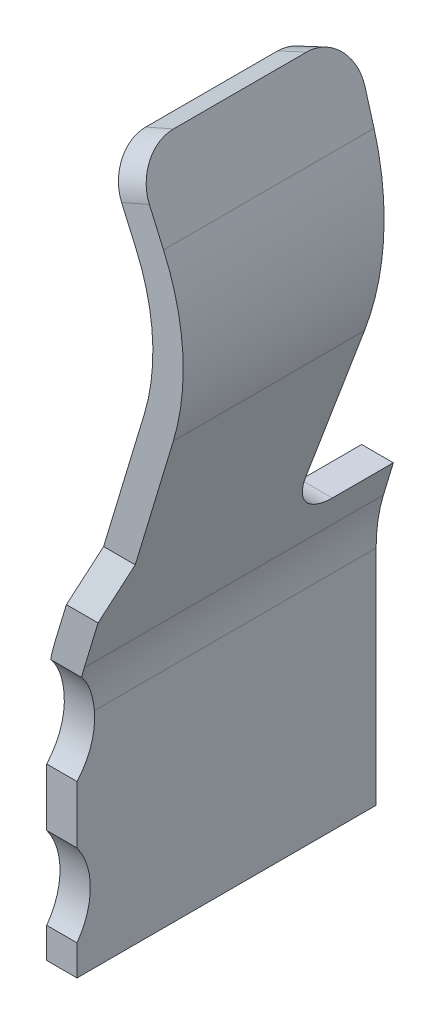
ISO-10303-21;
HEADER;
FILE_DESCRIPTION(('STEP AP214'),'2;1');
FILE_NAME('part.step','',(''),(''),'','','');
FILE_SCHEMA(('AUTOMOTIVE_DESIGN { 1 0 10303 214 1 1 1 1 }'));
ENDSEC;
DATA;
#1=APPLICATION_CONTEXT('core data for automotive mechanical design processes');
#2=APPLICATION_PROTOCOL_DEFINITION('international standard','automotive_design',2000,#1);
#3=PRODUCT_CONTEXT('',#1,'mechanical');
#4=PRODUCT('Part','Part','',(#3));
#5=PRODUCT_RELATED_PRODUCT_CATEGORY('part','',(#4));
#6=PRODUCT_DEFINITION_FORMATION('','',#4);
#7=PRODUCT_DEFINITION_CONTEXT('part definition',#1,'design');
#8=PRODUCT_DEFINITION('design','',#6,#7);
#9=PRODUCT_DEFINITION_SHAPE('','',#8);
#10=(LENGTH_UNIT() NAMED_UNIT(*) SI_UNIT(.MILLI.,.METRE.));
#11=(NAMED_UNIT(*) PLANE_ANGLE_UNIT() SI_UNIT($,.RADIAN.));
#12=(NAMED_UNIT(*) SI_UNIT($,.STERADIAN.) SOLID_ANGLE_UNIT());
#13=UNCERTAINTY_MEASURE_WITH_UNIT(LENGTH_MEASURE(1.E-05),#10,'distance_accuracy_value','');
#14=(GEOMETRIC_REPRESENTATION_CONTEXT(3) GLOBAL_UNCERTAINTY_ASSIGNED_CONTEXT((#13)) GLOBAL_UNIT_ASSIGNED_CONTEXT((#10,
#11,#12)) REPRESENTATION_CONTEXT('',''));
#15=CARTESIAN_POINT('',(0.,0.,0.));
#16=DIRECTION('',(0.,0.,1.));
#17=DIRECTION('',(1.,0.,0.));
#18=AXIS2_PLACEMENT_3D('',#15,#16,#17);
#19=CARTESIAN_POINT('',(8.30386274132999,3.53312166947706,-0.236832722369338));
#20=DIRECTION('',(-0.914255270392897,-0.402239697454475,0.0483789866630426));
#21=DIRECTION('',(0.402711251685505,-0.915327071470026,0.));
#22=AXIS2_PLACEMENT_3D('',#19,#20,#21);
#23=CYLINDRICAL_SURFACE('',#22,0.2);
#24=CARTESIAN_POINT('',(8.29035852267472,3.50329761180303,-0.434687053017797));
#25=CARTESIAN_POINT('',(8.23928159552815,3.6193909515076,-0.448650066039085));
#26=CARTESIAN_POINT('',(8.20101281648183,3.70637250294574,-0.363398989614743));
#27=CARTESIAN_POINT('',(8.20101281648182,3.70637250294574,-0.235652283248446));
#28=(BOUNDED_CURVE() B_SPLINE_CURVE(3,(#24,#25,#26,#27),.UNSPECIFIED.,.F.,
.F.) B_SPLINE_CURVE_WITH_KNOTS((4,4),(3.0320715031167,4.71238898038462),
.UNSPECIFIED.) CURVE() GEOMETRIC_REPRESENTATION_ITEM() RATIONAL_B_SPLINE_CURVE((1.,
0.77822974253387,0.77822974253387,1.)) REPRESENTATION_ITEM(''));
#29=CARTESIAN_POINT('',(8.29035852267472,3.50329761180303,-0.434687053017797));
#30=VERTEX_POINT('',#29);
#31=CARTESIAN_POINT('',(8.20101281648182,3.70637250294574,-0.235652283248446));
#32=VERTEX_POINT('',#31);
#33=EDGE_CURVE('E300',#30,#32,#28,.T.);
#34=ORIENTED_EDGE('',*,*,#33,.F.);
#35=DIRECTION('',(0.914255270392898,0.402239697454473,-0.0483789866630426));
#36=VECTOR('',#35,1.);
#37=CARTESIAN_POINT('',(-15.757177596038,-7.07676024092296,0.837819069551529));
#38=LINE('',#37,#36);
#39=CARTESIAN_POINT('',(8.15305946195422,3.44289092405021,-0.427421697659669));
#40=VERTEX_POINT('',#39);
#41=EDGE_CURVE('E11',#40,#30,#38,.T.);
#42=ORIENTED_EDGE('',*,*,#41,.F.);
#43=CARTESIAN_POINT('',(8.06371375576131,3.64596581519291,-0.228386927890318));
#44=CARTESIAN_POINT('',(8.06371375576132,3.64596581519291,-0.356133634256616));
#45=CARTESIAN_POINT('',(8.10198253480764,3.55898426375477,-0.441384710680957));
#46=CARTESIAN_POINT('',(8.15305946195422,3.44289092405021,-0.427421697659669));
#47=(BOUNDED_CURVE() B_SPLINE_CURVE(3,(#43,#44,#45,#46),.UNSPECIFIED.,.F.,
.F.) B_SPLINE_CURVE_WITH_KNOTS((4,4),(1.57079632679495,3.25111380406287),
.UNSPECIFIED.) CURVE() GEOMETRIC_REPRESENTATION_ITEM() RATIONAL_B_SPLINE_CURVE((1.,
0.778229742533869,0.778229742533869,1.)) REPRESENTATION_ITEM(''));
#48=CARTESIAN_POINT('',(8.06371375576131,3.64596581519291,-0.228386927890318));
#49=VERTEX_POINT('',#48);
#50=EDGE_CURVE('E309',#49,#40,#47,.T.);
#51=ORIENTED_EDGE('',*,*,#50,.F.);
#52=DIRECTION('',(-0.914255270392898,-0.402239697454473,0.0483789866630426));
#53=VECTOR('',#52,1.);
#54=CARTESIAN_POINT('',(8.22332049099288,3.71618708377106,-0.236832722369339));
#55=LINE('',#54,#53);
#56=EDGE_CURVE('E552',#32,#49,#55,.T.);
#57=ORIENTED_EDGE('',*,*,#56,.F.);
#58=EDGE_LOOP('',(#34,#42,#51,#57));
#59=FACE_BOUND('',#58,.T.);
#60=ADVANCED_FACE('F16',(#59),#23,.T.);
#61=CARTESIAN_POINT('',(8.28155506681891,3.52330708865174,0.423604352914838));
#62=DIRECTION('',(0.915327071470026,0.402711251685505,0.));
#63=DIRECTION('',(-0.402711251685505,0.915327071470026,0.));
#64=AXIS2_PLACEMENT_3D('',#61,#62,#63);
#65=CYLINDRICAL_SURFACE('',#64,0.2);
#66=CARTESIAN_POINT('',(8.14425600609841,3.46290040089891,0.423604352914837));
#67=DIRECTION('',(-0.915327071470029,-0.402711251685498,0.));
#68=DIRECTION('',(-0.402711251685498,0.915327071470029,0.));
#69=AXIS2_PLACEMENT_3D('',#66,#67,#68);
#70=CIRCLE('',#69,0.2);
#71=CARTESIAN_POINT('',(8.14425600609841,3.46290040089891,0.623604352914837));
#72=VERTEX_POINT('',#71);
#73=CARTESIAN_POINT('',(8.06371375576131,3.64596581519291,0.423604352914837));
#74=VERTEX_POINT('',#73);
#75=EDGE_CURVE('E306',#72,#74,#70,.T.);
#76=ORIENTED_EDGE('',*,*,#75,.F.);
#77=DIRECTION('',(-0.915327071470027,-0.402711251685503,0.));
#78=VECTOR('',#77,1.);
#79=CARTESIAN_POINT('',(-16.4730633966531,-7.36784176638169,0.623604352914803));
#80=LINE('',#79,#78);
#81=CARTESIAN_POINT('',(8.28155506681891,3.52330708865174,0.623604352914837));
#82=VERTEX_POINT('',#81);
#83=EDGE_CURVE('E27',#82,#72,#80,.T.);
#84=ORIENTED_EDGE('',*,*,#83,.F.);
#85=CARTESIAN_POINT('',(8.28155506681891,3.52330708865174,0.423604352914838));
#86=DIRECTION('',(0.915327071470029,0.402711251685498,0.));
#87=DIRECTION('',(0.402711251685498,-0.915327071470029,0.));
#88=AXIS2_PLACEMENT_3D('',#85,#86,#87);
#89=CIRCLE('',#88,0.2);
#90=CARTESIAN_POINT('',(8.20101281648182,3.70637250294574,0.423604352914837));
#91=VERTEX_POINT('',#90);
#92=EDGE_CURVE('E589',#91,#82,#89,.T.);
#93=ORIENTED_EDGE('',*,*,#92,.F.);
#94=DIRECTION('',(0.915327071470027,0.402711251685503,0.));
#95=VECTOR('',#94,1.);
#96=CARTESIAN_POINT('',(8.20101281648182,3.70637250294574,0.423604352914837));
#97=LINE('',#96,#95);
#98=EDGE_CURVE('E299',#74,#91,#97,.T.);
#99=ORIENTED_EDGE('',*,*,#98,.F.);
#100=EDGE_LOOP('',(#76,#84,#93,#99));
#101=FACE_BOUND('',#100,.T.);
#102=ADVANCED_FACE('F18',(#101),#65,.T.);
#103=CARTESIAN_POINT('',(-20.57,1.65634067151207,-0.212546111318104));
#104=DIRECTION('',(0.,-1.,0.));
#105=DIRECTION('',(0.,0.,-1.));
#106=AXIS2_PLACEMENT_3D('',#103,#104,#105);
#107=PLANE('',#106);
#108=DIRECTION('',(0.,0.,-1.));
#109=VECTOR('',#108,1.);
#110=CARTESIAN_POINT('',(7.96849659089442,1.65634067151207,-0.740000000000021));
#111=LINE('',#110,#109);
#112=CARTESIAN_POINT('',(7.96849659089442,1.65634067151207,-0.438042305987955));
#113=VERTEX_POINT('',#112);
#114=CARTESIAN_POINT('',(7.96849659089442,1.65634067151207,-0.740000000000021));
#115=VERTEX_POINT('',#114);
#116=EDGE_CURVE('E515',#113,#115,#111,.T.);
#117=ORIENTED_EDGE('',*,*,#116,.F.);
#118=DIRECTION('',(1.,0.,0.));
#119=VECTOR('',#118,1.);
#120=CARTESIAN_POINT('',(8.12516492105845,1.65634067151207,-0.438042305987954));
#121=LINE('',#120,#119);
#122=CARTESIAN_POINT('',(8.12516492105846,1.65634067151207,-0.438042305987954));
#123=VERTEX_POINT('',#122);
#124=EDGE_CURVE('E530',#113,#123,#121,.T.);
#125=ORIENTED_EDGE('',*,*,#124,.T.);
#126=DIRECTION('',(0.,0.,1.));
#127=VECTOR('',#126,1.);
#128=CARTESIAN_POINT('',(8.12516492105846,1.65634067151207,-0.74000000000002));
#129=LINE('',#128,#127);
#130=CARTESIAN_POINT('',(8.12516492105846,1.65634067151207,-0.74000000000002));
#131=VERTEX_POINT('',#130);
#132=EDGE_CURVE('E625',#131,#123,#129,.T.);
#133=ORIENTED_EDGE('',*,*,#132,.F.);
#134=DIRECTION('',(-1.,0.,0.));
#135=VECTOR('',#134,1.);
#136=CARTESIAN_POINT('',(8.89,1.65634067151207,-0.740000000000019));
#137=LINE('',#136,#135);
#138=EDGE_CURVE('E246',#131,#115,#137,.T.);
#139=ORIENTED_EDGE('',*,*,#138,.T.);
#140=EDGE_LOOP('',(#117,#125,#133,#139));
#141=FACE_BOUND('',#140,.T.);
#142=ADVANCED_FACE('F368',(#141),#107,.F.);
#143=CARTESIAN_POINT('',(-20.57,3.70637250294571,-0.459111687165995));
#144=DIRECTION('',(0.,0.119413416546905,0.992844618230162));
#145=DIRECTION('',(1.,0.,0.));
#146=AXIS2_PLACEMENT_3D('',#143,#144,#145);
#147=PLANE('',#146);
#148=DIRECTION('',(0.286748539926818,0.951150986717315,-0.11439875574724));
#149=VECTOR('',#148,1.);
#150=CARTESIAN_POINT('',(8.09412236488806,1.55337185451571,-0.200161637444148));
#151=LINE('',#150,#149);
#152=CARTESIAN_POINT('',(8.19266002273041,1.88022335482146,-0.239473382341922));
#153=VERTEX_POINT('',#152);
#154=CARTESIAN_POINT('',(8.40020176045378,2.56864369924933,-0.322272466749581));
#155=VERTEX_POINT('',#154);
#156=EDGE_CURVE('E519',#153,#155,#151,.T.);
#157=ORIENTED_EDGE('',*,*,#156,.F.);
#158=DIRECTION('',(-1.,0.,0.));
#159=VECTOR('',#158,1.);
#160=CARTESIAN_POINT('',(7.96849659089441,1.88022335482146,-0.239473382341922));
#161=LINE('',#160,#159);
#162=CARTESIAN_POINT('',(8.03599169256638,1.88022335482146,-0.239473382341922));
#163=VERTEX_POINT('',#162);
#164=EDGE_CURVE('E271',#153,#163,#161,.T.);
#165=ORIENTED_EDGE('',*,*,#164,.T.);
#166=DIRECTION('',(-0.28674853992682,-0.951150986717314,0.11439875574724));
#167=VECTOR('',#166,1.);
#168=CARTESIAN_POINT('',(7.9503360451115,1.59610175610151,-0.205300934614505));
#169=LINE('',#168,#167);
#170=CARTESIAN_POINT('',(8.25658626409634,2.61194022573825,-0.327479914176623));
#171=VERTEX_POINT('',#170);
#172=EDGE_CURVE('E510',#171,#163,#169,.T.);
#173=ORIENTED_EDGE('',*,*,#172,.F.);
#174=CARTESIAN_POINT('',(8.21447669318342,3.30329498734983,-0.410631932744419));
#175=CARTESIAN_POINT('',(8.3114549897076,3.08287189317973,-0.384120760424612));
#176=CARTESIAN_POINT('',(8.32609551117657,2.84250387207174,-0.355210731501567));
#177=CARTESIAN_POINT('',(8.25658626409634,2.61194022573825,-0.327479914176623));
#178=(BOUNDED_CURVE() B_SPLINE_CURVE(3,(#174,#175,#176,#177),.UNSPECIFIED.,.F.,
.F.) B_SPLINE_CURVE_WITH_KNOTS((4,4),(4.29791199977039,5.00519872138853),
.UNSPECIFIED.) CURVE() GEOMETRIC_REPRESENTATION_ITEM() RATIONAL_B_SPLINE_CURVE((1.,
0.958744787021091,0.958744787021091,1.)) REPRESENTATION_ITEM(''));
#179=CARTESIAN_POINT('',(8.21447669318342,3.30329498734983,-0.410631932744419));
#180=VERTEX_POINT('',#179);
#181=EDGE_CURVE('E319',#180,#171,#178,.T.);
#182=ORIENTED_EDGE('',*,*,#181,.F.);
#183=DIRECTION('',(0.400292818236851,-0.909830186054405,0.109428936813833));
#184=VECTOR('',#183,1.);
#185=CARTESIAN_POINT('',(8.20004918034407,3.33608744850051,-0.414576013974334));
#186=LINE('',#185,#184);
#187=EDGE_CURVE('E599',#40,#180,#186,.T.);
#188=ORIENTED_EDGE('',*,*,#187,.F.);
#189=ORIENTED_EDGE('',*,*,#41,.T.);
#190=DIRECTION('',(-0.40029281823685,0.909830186054405,-0.109428936813833));
#191=VECTOR('',#190,1.);
#192=CARTESIAN_POINT('',(8.33766648991178,3.39577078475993,-0.421754368938235));
#193=LINE('',#192,#191);
#194=CARTESIAN_POINT('',(8.35177575390392,3.36370167510267,-0.417897288102547));
#195=VERTEX_POINT('',#194);
#196=EDGE_CURVE('E563',#195,#30,#193,.T.);
#197=ORIENTED_EDGE('',*,*,#196,.F.);
#198=CARTESIAN_POINT('',(8.40020176045378,2.56864369924933,-0.322272466749581));
#199=CARTESIAN_POINT('',(8.48013739459604,2.83379189253285,-0.354162906673267));
#200=CARTESIAN_POINT('',(8.46330079490673,3.11021511680704,-0.387409439934769));
#201=CARTESIAN_POINT('',(8.35177575390392,3.36370167510267,-0.417897288102547));
#202=(BOUNDED_CURVE() B_SPLINE_CURVE(3,(#198,#199,#200,#201),.UNSPECIFIED.,.F.,
.F.) B_SPLINE_CURVE_WITH_KNOTS((4,4),(1.27798658579106,1.98527330740919),
.UNSPECIFIED.) CURVE() GEOMETRIC_REPRESENTATION_ITEM() RATIONAL_B_SPLINE_CURVE((1.,
0.958744787021091,0.958744787021091,1.)) REPRESENTATION_ITEM(''));
#203=EDGE_CURVE('E276',#155,#195,#202,.T.);
#204=ORIENTED_EDGE('',*,*,#203,.F.);
#205=EDGE_LOOP('',(#157,#165,#173,#182,#188,#189,#197,#204));
#206=FACE_BOUND('',#205,.T.);
#207=ADVANCED_FACE('F365',(#206),#147,.F.);
#208=CARTESIAN_POINT('',(-20.57,1.94413292378283,0.623604352914797));
#209=DIRECTION('',(0.,0.,-1.));
#210=DIRECTION('',(0.,-1.,0.));
#211=AXIS2_PLACEMENT_3D('',#208,#209,#210);
#212=PLANE('',#211);
#213=DIRECTION('',(0.4027112516855,-0.915327071470028,0.));
#214=VECTOR('',#213,1.);
#215=CARTESIAN_POINT('',(8.35177575390392,3.36370167510267,0.623604352914838));
#216=LINE('',#215,#214);
#217=CARTESIAN_POINT('',(8.35177575390392,3.36370167510267,0.623604352914838));
#218=VERTEX_POINT('',#217);
#219=EDGE_CURVE('E570',#82,#218,#216,.T.);
#220=ORIENTED_EDGE('',*,*,#219,.F.);
#221=ORIENTED_EDGE('',*,*,#83,.T.);
#222=DIRECTION('',(-0.402711251685501,0.915327071470028,0.));
#223=VECTOR('',#222,1.);
#224=CARTESIAN_POINT('',(8.21447669318342,3.30329498734984,0.623604352914837));
#225=LINE('',#224,#223);
#226=CARTESIAN_POINT('',(8.21447669318341,3.30329498734983,0.623604352914837));
#227=VERTEX_POINT('',#226);
#228=EDGE_CURVE('E310',#227,#72,#225,.T.);
#229=ORIENTED_EDGE('',*,*,#228,.F.);
#230=CARTESIAN_POINT('',(7.29914962171338,2.90058373566433,0.623604352914836));
#231=DIRECTION('',(0.,0.,1.));
#232=DIRECTION('',(-1.,0.,0.));
#233=AXIS2_PLACEMENT_3D('',#230,#231,#232);
#234=CIRCLE('',#233,1.);
#235=CARTESIAN_POINT('',(8.25658626409634,2.61194022573825,0.623604352914837));
#236=VERTEX_POINT('',#235);
#237=EDGE_CURVE('E333',#236,#227,#234,.T.);
#238=ORIENTED_EDGE('',*,*,#237,.F.);
#239=DIRECTION('',(0.28864350992609,0.957436642382956,0.));
#240=VECTOR('',#239,1.);
#241=CARTESIAN_POINT('',(7.93256335761704,1.53714937485737,0.623604352914836));
#242=LINE('',#241,#240);
#243=CARTESIAN_POINT('',(8.05525884977164,1.94413292378283,0.623604352914837));
#244=VERTEX_POINT('',#243);
#245=EDGE_CURVE('E301',#244,#236,#242,.T.);
#246=ORIENTED_EDGE('',*,*,#245,.F.);
#247=DIRECTION('',(1.,0.,0.));
#248=VECTOR('',#247,1.);
#249=CARTESIAN_POINT('',(-20.57,1.94413292378283,0.623604352914797));
#250=LINE('',#249,#248);
#251=CARTESIAN_POINT('',(8.21192717993567,1.94413292378283,0.623604352914837));
#252=VERTEX_POINT('',#251);
#253=EDGE_CURVE('E284',#244,#252,#250,.T.);
#254=ORIENTED_EDGE('',*,*,#253,.T.);
#255=DIRECTION('',(-0.288643509926088,-0.957436642382956,0.));
#256=VECTOR('',#255,1.);
#257=CARTESIAN_POINT('',(8.07617885397448,1.49385284836845,0.623604352914837));
#258=LINE('',#257,#256);
#259=CARTESIAN_POINT('',(8.40020176045378,2.56864369924933,0.623604352914837));
#260=VERTEX_POINT('',#259);
#261=EDGE_CURVE('E559',#260,#252,#258,.T.);
#262=ORIENTED_EDGE('',*,*,#261,.F.);
#263=CARTESIAN_POINT('',(7.29914962171338,2.90058373566433,0.623604352914836));
#264=DIRECTION('',(0.,0.,-1.));
#265=DIRECTION('',(-1.,0.,0.));
#266=AXIS2_PLACEMENT_3D('',#263,#264,#265);
#267=CIRCLE('',#266,1.15);
#268=EDGE_CURVE('E616',#218,#260,#267,.T.);
#269=ORIENTED_EDGE('',*,*,#268,.F.);
#270=EDGE_LOOP('',(#220,#221,#229,#238,#246,#254,#262,#269));
#271=FACE_BOUND('',#270,.T.);
#272=ADVANCED_FACE('F362',(#271),#212,.F.);
#273=CARTESIAN_POINT('',(-20.57,1.7003498353216,0.749999999999972));
#274=DIRECTION('',(0.,-0.460287319631494,-0.887770005906065));
#275=DIRECTION('',(0.,-0.887770005906065,0.460287319631494));
#276=AXIS2_PLACEMENT_3D('',#273,#274,#275);
#277=PLANE('',#276);
#278=ORIENTED_EDGE('',*,*,#253,.F.);
#279=DIRECTION('',(0.258541028225373,0.857586072334425,-0.444637678635293));
#280=VECTOR('',#279,1.);
#281=CARTESIAN_POINT('',(8.11357656169356,2.13757401070795,0.523309818502746));
#282=LINE('',#281,#280);
#283=CARTESIAN_POINT('',(7.98757891232074,1.7196371362757,0.73999999999998));
#284=VERTEX_POINT('',#283);
#285=EDGE_CURVE('E305',#284,#244,#282,.T.);
#286=ORIENTED_EDGE('',*,*,#285,.F.);
#287=DIRECTION('',(-1.,0.,0.));
#288=VECTOR('',#287,1.);
#289=CARTESIAN_POINT('',(8.89,1.7196371362757,0.739999999999981));
#290=LINE('',#289,#288);
#291=CARTESIAN_POINT('',(8.14424724248477,1.7196371362757,0.73999999999998));
#292=VERTEX_POINT('',#291);
#293=EDGE_CURVE('E575',#292,#284,#290,.T.);
#294=ORIENTED_EDGE('',*,*,#293,.F.);
#295=DIRECTION('',(-0.258541028225372,-0.857586072334425,0.444637678635293));
#296=VECTOR('',#295,1.);
#297=CARTESIAN_POINT('',(8.2597726380838,2.10283732290249,0.541319952677682));
#298=LINE('',#297,#296);
#299=EDGE_CURVE('E283',#252,#292,#298,.T.);
#300=ORIENTED_EDGE('',*,*,#299,.F.);
#301=EDGE_LOOP('',(#278,#286,#294,#300));
#302=FACE_BOUND('',#301,.T.);
#303=ADVANCED_FACE('F364',(#302),#277,.F.);
#304=CARTESIAN_POINT('',(8.89,1.24850586493128,0.739999999999981));
#305=DIRECTION('',(0.,0.,-1.));
#306=DIRECTION('',(0.,-1.,0.));
#307=AXIS2_PLACEMENT_3D('',#304,#305,#306);
#308=PLANE('',#307);
#309=DIRECTION('',(0.,1.,0.));
#310=VECTOR('',#309,1.);
#311=CARTESIAN_POINT('',(8.04,0.145965815192914,0.73999999999998));
#312=LINE('',#311,#310);
#313=CARTESIAN_POINT('',(8.04,0.145965815192914,0.73999999999998));
#314=VERTEX_POINT('',#313);
#315=CARTESIAN_POINT('',(8.04,0.296740599868486,0.73999999999998));
#316=VERTEX_POINT('',#315);
#317=EDGE_CURVE('E314',#314,#316,#312,.T.);
#318=ORIENTED_EDGE('',*,*,#317,.T.);
#319=DIRECTION('',(-1.,0.,0.));
#320=VECTOR('',#319,1.);
#321=CARTESIAN_POINT('',(-20.57,0.296740599868486,0.73999999999994));
#322=LINE('',#321,#320);
#323=CARTESIAN_POINT('',(7.89,0.296740599868486,0.739999999999979));
#324=VERTEX_POINT('',#323);
#325=EDGE_CURVE('E242',#316,#324,#322,.T.);
#326=ORIENTED_EDGE('',*,*,#325,.T.);
#327=DIRECTION('',(0.,-1.,0.));
#328=VECTOR('',#327,1.);
#329=CARTESIAN_POINT('',(7.89,0.145965815192914,0.739999999999979));
#330=LINE('',#329,#328);
#331=CARTESIAN_POINT('',(7.89,0.145965815192914,0.739999999999979));
#332=VERTEX_POINT('',#331);
#333=EDGE_CURVE('E237',#324,#332,#330,.T.);
#334=ORIENTED_EDGE('',*,*,#333,.T.);
#335=DIRECTION('',(1.,0.,0.));
#336=VECTOR('',#335,1.);
#337=CARTESIAN_POINT('',(8.04,0.145965815192914,0.73999999999998));
#338=LINE('',#337,#336);
#339=EDGE_CURVE('E240',#332,#314,#338,.T.);
#340=ORIENTED_EDGE('',*,*,#339,.T.);
#341=EDGE_LOOP('',(#318,#326,#334,#340));
#342=FACE_BOUND('',#341,.T.);
#343=ADVANCED_FACE('F238',(#342),#308,.F.);
#344=CARTESIAN_POINT('',(8.89,1.24850586493128,-0.740000000000019));
#345=DIRECTION('',(0.,0.,-1.));
#346=DIRECTION('',(0.,-1.,0.));
#347=AXIS2_PLACEMENT_3D('',#344,#345,#346);
#348=PLANE('',#347);
#349=ORIENTED_EDGE('',*,*,#138,.F.);
#350=DIRECTION('',(0.288643509926088,0.957436642382956,0.));
#351=VECTOR('',#350,1.);
#352=CARTESIAN_POINT('',(8.07617885397449,1.49385284836845,-0.74000000000002));
#353=LINE('',#352,#351);
#354=CARTESIAN_POINT('',(8.07617885397449,1.49385284836845,-0.74000000000002));
#355=VERTEX_POINT('',#354);
#356=EDGE_CURVE('E318',#355,#131,#353,.T.);
#357=ORIENTED_EDGE('',*,*,#356,.F.);
#358=CARTESIAN_POINT('',(8.89,1.24850586493128,-0.740000000000019));
#359=DIRECTION('',(0.,0.,-1.));
#360=DIRECTION('',(1.,0.,0.));
#361=AXIS2_PLACEMENT_3D('',#358,#359,#360);
#362=CIRCLE('',#361,0.85);
#363=CARTESIAN_POINT('',(8.04,1.24850586493128,-0.74000000000002));
#364=VERTEX_POINT('',#363);
#365=EDGE_CURVE('E313',#364,#355,#362,.T.);
#366=ORIENTED_EDGE('',*,*,#365,.F.);
#367=DIRECTION('',(0.,1.,0.));
#368=VECTOR('',#367,1.);
#369=CARTESIAN_POINT('',(8.04,0.145965815192914,-0.74000000000002));
#370=LINE('',#369,#368);
#371=CARTESIAN_POINT('',(8.04,0.145965815192914,-0.74000000000002));
#372=VERTEX_POINT('',#371);
#373=EDGE_CURVE('E214',#372,#364,#370,.T.);
#374=ORIENTED_EDGE('',*,*,#373,.F.);
#375=DIRECTION('',(1.,0.,0.));
#376=VECTOR('',#375,1.);
#377=CARTESIAN_POINT('',(8.04,0.145965815192914,-0.74000000000002));
#378=LINE('',#377,#376);
#379=CARTESIAN_POINT('',(7.89,0.145965815192914,-0.740000000000021));
#380=VERTEX_POINT('',#379);
#381=EDGE_CURVE('E254',#380,#372,#378,.T.);
#382=ORIENTED_EDGE('',*,*,#381,.F.);
#383=DIRECTION('',(0.,-1.,0.));
#384=VECTOR('',#383,1.);
#385=CARTESIAN_POINT('',(7.89,0.145965815192914,-0.740000000000021));
#386=LINE('',#385,#384);
#387=CARTESIAN_POINT('',(7.89,1.24850586493128,-0.740000000000021));
#388=VERTEX_POINT('',#387);
#389=EDGE_CURVE('E42',#388,#380,#386,.T.);
#390=ORIENTED_EDGE('',*,*,#389,.F.);
#391=CARTESIAN_POINT('',(8.89,1.24850586493128,-0.740000000000019));
#392=DIRECTION('',(0.,0.,1.));
#393=DIRECTION('',(1.,0.,0.));
#394=AXIS2_PLACEMENT_3D('',#391,#392,#393);
#395=CIRCLE('',#394,1.);
#396=CARTESIAN_POINT('',(7.93256335761704,1.53714937485737,-0.740000000000021));
#397=VERTEX_POINT('',#396);
#398=EDGE_CURVE('E581',#397,#388,#395,.T.);
#399=ORIENTED_EDGE('',*,*,#398,.F.);
#400=DIRECTION('',(-0.28864350992609,-0.957436642382956,0.));
#401=VECTOR('',#400,1.);
#402=CARTESIAN_POINT('',(7.93256335761704,1.53714937485737,-0.740000000000021));
#403=LINE('',#402,#401);
#404=EDGE_CURVE('E580',#115,#397,#403,.T.);
#405=ORIENTED_EDGE('',*,*,#404,.F.);
#406=EDGE_LOOP('',(#349,#357,#366,#374,#382,#390,#399,#405));
#407=FACE_BOUND('',#406,.T.);
#408=ADVANCED_FACE('F387',(#407),#348,.T.);
#409=CARTESIAN_POINT('',(7.89,0.145965815192914,-0.740000000000021));
#410=DIRECTION('',(1.,0.,0.));
#411=DIRECTION('',(0.,1.,0.));
#412=AXIS2_PLACEMENT_3D('',#409,#410,#411);
#413=PLANE('',#412);
#414=DIRECTION('',(0.,-1.,0.));
#415=VECTOR('',#414,1.);
#416=CARTESIAN_POINT('',(7.89,0.145965815192914,0.739999999999979));
#417=LINE('',#416,#415);
#418=CARTESIAN_POINT('',(7.89,0.988055123608201,0.739999999999979));
#419=VERTEX_POINT('',#418);
#420=CARTESIAN_POINT('',(7.89,0.703259400131467,0.739999999999979));
#421=VERTEX_POINT('',#420);
#422=EDGE_CURVE('E260',#419,#421,#417,.T.);
#423=ORIENTED_EDGE('',*,*,#422,.F.);
#424=CARTESIAN_POINT('',(7.89,1.21669179396546,0.995153761033096));
#425=DIRECTION('',(1.,0.,0.));
#426=DIRECTION('',(0.,1.,0.));
#427=AXIS2_PLACEMENT_3D('',#424,#425,#426);
#428=CIRCLE('',#427,0.342604974863759);
#429=CARTESIAN_POINT('',(7.89,1.24850586493128,0.654029100989324));
#430=VERTEX_POINT('',#429);
#431=EDGE_CURVE('E274',#419,#430,#428,.T.);
#432=ORIENTED_EDGE('',*,*,#431,.T.);
#433=DIRECTION('',(0.,0.,1.));
#434=VECTOR('',#433,1.);
#435=CARTESIAN_POINT('',(7.89,1.24850586493128,-0.740000000000021));
#436=LINE('',#435,#434);
#437=EDGE_CURVE('E304',#388,#430,#436,.T.);
#438=ORIENTED_EDGE('',*,*,#437,.F.);
#439=ORIENTED_EDGE('',*,*,#389,.T.);
#440=DIRECTION('',(0.,0.,1.));
#441=VECTOR('',#440,1.);
#442=CARTESIAN_POINT('',(7.89,0.145965815192914,-0.740000000000021));
#443=LINE('',#442,#441);
#444=EDGE_CURVE('E249',#380,#332,#443,.T.);
#445=ORIENTED_EDGE('',*,*,#444,.T.);
#446=ORIENTED_EDGE('',*,*,#333,.F.);
#447=CARTESIAN_POINT('',(7.89,0.499999999999977,1.0194268345702));
#448=DIRECTION('',(1.,0.,0.));
#449=DIRECTION('',(0.,1.,0.));
#450=AXIS2_PLACEMENT_3D('',#447,#448,#449);
#451=CIRCLE('',#450,0.345533991988848);
#452=EDGE_CURVE('E473',#324,#421,#451,.T.);
#453=ORIENTED_EDGE('',*,*,#452,.T.);
#454=EDGE_LOOP('',(#423,#432,#438,#439,#445,#446,#453));
#455=FACE_BOUND('',#454,.T.);
#456=ADVANCED_FACE('F250',(#455),#413,.F.);
#457=CARTESIAN_POINT('',(8.89,1.24850586493128,-0.740000000000019));
#458=DIRECTION('',(0.,0.,1.));
#459=DIRECTION('',(-1.,0.,0.));
#460=AXIS2_PLACEMENT_3D('',#457,#458,#459);
#461=CYLINDRICAL_SURFACE('',#460,1.);
#462=ORIENTED_EDGE('',*,*,#437,.T.);
#463=CARTESIAN_POINT('',(7.89,1.24850586493127,0.654029100989324));
#464=CARTESIAN_POINT('',(7.88999992592637,1.25306932177748,0.654454497923835));
#465=CARTESIAN_POINT('',(7.89003123527863,1.25762446546712,0.654969794425774));
#466=CARTESIAN_POINT('',(7.89015516509568,1.26669234380872,0.656178662703507));
#467=CARTESIAN_POINT('',(7.89024754920297,1.27120517419842,0.656871540938563));
#468=CARTESIAN_POINT('',(7.89049191329322,1.28018764830056,0.658435530000101));
#469=CARTESIAN_POINT('',(7.89064375710387,1.28465736694881,0.659306231418194));
#470=CARTESIAN_POINT('',(7.89100522296896,1.29355289226453,0.661225514697385));
#471=CARTESIAN_POINT('',(7.8912148055409,1.29797872680563,0.66227397481712));
#472=CARTESIAN_POINT('',(7.89168997207293,1.30678583476397,0.664548502475786));
#473=CARTESIAN_POINT('',(7.89195560747397,1.31116706334694,0.665774732832754));
#474=CARTESIAN_POINT('',(7.89254110847119,1.31988437499395,0.668404514864849));
#475=CARTESIAN_POINT('',(7.89286110900543,1.32422031651338,0.669808505488944));
#476=CARTESIAN_POINT('',(7.89355358930377,1.33284654509273,0.672793524574298));
#477=CARTESIAN_POINT('',(7.89392627862693,1.33713657245114,0.67437525453736));
#478=CARTESIAN_POINT('',(7.89472239758146,1.34567049059148,0.677715533217567));
#479=CARTESIAN_POINT('',(7.89514610132699,1.34991398511754,0.679475028174295));
#480=CARTESIAN_POINT('',(7.89603678150611,1.35830019523904,0.683146652073494));
#481=CARTESIAN_POINT('',(7.89650349280442,1.36244335249443,0.685057836907499));
#482=CARTESIAN_POINT('',(7.89747687139799,1.37063194178074,0.6890335315101));
#483=CARTESIAN_POINT('',(7.89798338788338,1.3746776733665,0.691097460992356));
#484=CARTESIAN_POINT('',(7.89903286831764,1.38267128376232,0.695378434355305));
#485=CARTESIAN_POINT('',(7.89957575264737,1.3866193519919,0.69759514404689));
#486=CARTESIAN_POINT('',(7.90069455701777,1.39441764648526,0.702181418874191));
#487=CARTESIAN_POINT('',(7.90127045700561,1.39826793013232,0.704550891332612));
#488=CARTESIAN_POINT('',(7.90245197037195,1.40587073759695,0.709442454924467));
#489=CARTESIAN_POINT('',(7.90305761081716,1.40962316741917,0.711964685588729));
#490=CARTESIAN_POINT('',(7.90429537926365,1.4170304504751,0.717161525963165));
#491=CARTESIAN_POINT('',(7.90492756852699,1.42068504210779,0.719836493879691));
#492=CARTESIAN_POINT('',(7.90621529345779,1.42789683764576,0.725338623347788));
#493=CARTESIAN_POINT('',(7.90687091152925,1.43145359950846,0.728166344681211));
#494=CARTESIAN_POINT('',(7.90820248405423,1.43847023752972,0.733973670299352));
#495=CARTESIAN_POINT('',(7.90887852949904,1.44192948379825,0.736954014976151));
#496=CARTESIAN_POINT('',(7.90956088186527,1.44532846432271,0.73999999999998));
#497=B_SPLINE_CURVE_WITH_KNOTS('',3,(#463,#464,#465,#466,#467,#468,#469,#470,#471,#472,#473,
#474,#475,#476,#477,#478,#479,#480,#481,#482,#483,#484,#485,#486,#487,#488,#489,#490,#491,#492,
#493,#494,#495,#496),.UNSPECIFIED.,.F.,.F.,(4,2,2,2,2,2,2,2,2,2,2,2,2,2,2,2,4),(0.,
0.013748827736232,0.0274447569667543,0.0411095020469267,0.0547649260984996,0.0684329369744623,
0.0821353821572885,0.0958939450956066,0.109730045405059,0.123485924962941,0.137191991355335,
0.150868974599206,0.164537737053089,0.178219178700539,0.191934141578145,0.205703315519925,
0.219547147320743),.UNSPECIFIED.);
#498=CARTESIAN_POINT('',(7.90956088186527,1.44532846432271,0.739999999999979));
#499=VERTEX_POINT('',#498);
#500=EDGE_CURVE('E342',#430,#499,#497,.T.);
#501=ORIENTED_EDGE('',*,*,#500,.T.);
#502=CARTESIAN_POINT('',(8.89,1.24850586493128,0.739999999999981));
#503=DIRECTION('',(0.,0.,1.));
#504=DIRECTION('',(1.,0.,0.));
#505=AXIS2_PLACEMENT_3D('',#502,#503,#504);
#506=CIRCLE('',#505,1.);
#507=CARTESIAN_POINT('',(7.93256335761704,1.53714937485737,0.739999999999979));
#508=VERTEX_POINT('',#507);
#509=EDGE_CURVE('E440',#508,#499,#506,.T.);
#510=ORIENTED_EDGE('',*,*,#509,.F.);
#511=DIRECTION('',(0.,0.,1.));
#512=VECTOR('',#511,1.);
#513=CARTESIAN_POINT('',(7.93256335761704,1.53714937485737,-0.740000000000021));
#514=LINE('',#513,#512);
#515=EDGE_CURVE('E577',#397,#508,#514,.T.);
#516=ORIENTED_EDGE('',*,*,#515,.F.);
#517=ORIENTED_EDGE('',*,*,#398,.T.);
#518=EDGE_LOOP('',(#462,#501,#510,#516,#517));
#519=FACE_BOUND('',#518,.T.);
#520=ADVANCED_FACE('F349',(#519),#461,.T.);
#521=CARTESIAN_POINT('',(7.93256335761704,1.53714937485737,-0.740000000000021));
#522=DIRECTION('',(0.957436642382956,-0.28864350992609,0.));
#523=DIRECTION('',(0.,0.,-1.));
#524=AXIS2_PLACEMENT_3D('',#521,#522,#523);
#525=PLANE('',#524);
#526=ORIENTED_EDGE('',*,*,#172,.T.);
#527=CARTESIAN_POINT('',(8.03599169256638,1.88022335482146,-0.239473382341922));
#528=CARTESIAN_POINT('',(8.03360172570136,1.87229578405696,-0.238519901512672));
#529=CARTESIAN_POINT('',(8.03119884441548,1.86432537588468,-0.238042305987954));
#530=CARTESIAN_POINT('',(8.02879165317817,1.85634067151208,-0.238042305987954));
#531=(BOUNDED_CURVE() B_SPLINE_CURVE(3,(#527,#528,#529,#530),.UNSPECIFIED.,.F.,
.F.) B_SPLINE_CURVE_WITH_KNOTS((4,4),(4.59268992994791,4.71238898038469),
.UNSPECIFIED.) CURVE() GEOMETRIC_REPRESENTATION_ITEM() RATIONAL_B_SPLINE_CURVE((1.,
0.998806367803328,0.998806367803328,1.)) REPRESENTATION_ITEM(''));
#532=CARTESIAN_POINT('',(8.02879165317817,1.85634067151208,-0.238042305987954));
#533=VERTEX_POINT('',#532);
#534=EDGE_CURVE('E275',#163,#533,#531,.T.);
#535=ORIENTED_EDGE('',*,*,#534,.T.);
#536=CARTESIAN_POINT('',(8.02879165317817,1.85634067151208,-0.238042305987954));
#537=CARTESIAN_POINT('',(7.99347162343649,1.73918338398669,-0.238042305987954));
#538=CARTESIAN_POINT('',(7.96849659089443,1.65634067151208,-0.320885018462573));
#539=CARTESIAN_POINT('',(7.96849659089442,1.65634067151207,-0.438042305987955));
#540=(BOUNDED_CURVE() B_SPLINE_CURVE(3,(#536,#537,#538,#539),.UNSPECIFIED.,.F.,
.F.) B_SPLINE_CURVE_WITH_KNOTS((4,4),(4.71238898038469,6.28318530717959),
.UNSPECIFIED.) CURVE() GEOMETRIC_REPRESENTATION_ITEM() RATIONAL_B_SPLINE_CURVE((1.,
0.804737854124365,0.804737854124365,1.)) REPRESENTATION_ITEM(''));
#541=EDGE_CURVE('E523',#533,#113,#540,.T.);
#542=ORIENTED_EDGE('',*,*,#541,.T.);
#543=ORIENTED_EDGE('',*,*,#116,.T.);
#544=ORIENTED_EDGE('',*,*,#404,.T.);
#545=ORIENTED_EDGE('',*,*,#515,.T.);
#546=DIRECTION('',(-0.28864350992609,-0.957436642382956,0.));
#547=VECTOR('',#546,1.);
#548=CARTESIAN_POINT('',(7.93256335761704,1.53714937485737,0.739999999999979));
#549=LINE('',#548,#547);
#550=EDGE_CURVE('E617',#284,#508,#549,.T.);
#551=ORIENTED_EDGE('',*,*,#550,.F.);
#552=ORIENTED_EDGE('',*,*,#285,.T.);
#553=ORIENTED_EDGE('',*,*,#245,.T.);
#554=DIRECTION('',(0.,0.,1.));
#555=VECTOR('',#554,1.);
#556=CARTESIAN_POINT('',(8.25658626409634,2.61194022573825,-0.74000000000002));
#557=LINE('',#556,#555);
#558=EDGE_CURVE('E325',#171,#236,#557,.T.);
#559=ORIENTED_EDGE('',*,*,#558,.F.);
#560=EDGE_LOOP('',(#526,#535,#542,#543,#544,#545,#551,#552,#553,#559));
#561=FACE_BOUND('',#560,.T.);
#562=ADVANCED_FACE('F359',(#561),#525,.F.);
#563=CARTESIAN_POINT('',(7.29914962171339,2.90058373566433,-0.740000000000021));
#564=DIRECTION('',(0.,0.,1.));
#565=DIRECTION('',(-1.,0.,0.));
#566=AXIS2_PLACEMENT_3D('',#563,#564,#565);
#567=CYLINDRICAL_SURFACE('',#566,1.);
#568=DIRECTION('',(0.,0.,1.));
#569=VECTOR('',#568,1.);
#570=CARTESIAN_POINT('',(8.21447669318342,3.30329498734983,-0.74000000000002));
#571=LINE('',#570,#569);
#572=EDGE_CURVE('E326',#180,#227,#571,.T.);
#573=ORIENTED_EDGE('',*,*,#572,.F.);
#574=ORIENTED_EDGE('',*,*,#181,.T.);
#575=ORIENTED_EDGE('',*,*,#558,.T.);
#576=ORIENTED_EDGE('',*,*,#237,.T.);
#577=EDGE_LOOP('',(#573,#574,#575,#576));
#578=FACE_BOUND('',#577,.T.);
#579=ADVANCED_FACE('F400',(#578),#567,.F.);
#580=CARTESIAN_POINT('',(8.21447669318342,3.30329498734984,-0.74000000000002));
#581=DIRECTION('',(0.915327071470028,0.402711251685501,0.));
#582=DIRECTION('',(0.,0.,-1.));
#583=AXIS2_PLACEMENT_3D('',#580,#581,#582);
#584=PLANE('',#583);
#585=ORIENTED_EDGE('',*,*,#228,.T.);
#586=ORIENTED_EDGE('',*,*,#75,.T.);
#587=DIRECTION('',(0.,0.,1.));
#588=VECTOR('',#587,1.);
#589=CARTESIAN_POINT('',(8.06371375576131,3.64596581519291,-0.740000000000021));
#590=LINE('',#589,#588);
#591=EDGE_CURVE('E295',#49,#74,#590,.T.);
#592=ORIENTED_EDGE('',*,*,#591,.F.);
#593=ORIENTED_EDGE('',*,*,#50,.T.);
#594=ORIENTED_EDGE('',*,*,#187,.T.);
#595=ORIENTED_EDGE('',*,*,#572,.T.);
#596=EDGE_LOOP('',(#585,#586,#592,#593,#594,#595));
#597=FACE_BOUND('',#596,.T.);
#598=ADVANCED_FACE('F403',(#597),#584,.F.);
#599=CARTESIAN_POINT('',(8.20101281648182,3.70637250294574,-0.74000000000002));
#600=DIRECTION('',(0.402711251685503,-0.915327071470027,0.));
#601=DIRECTION('',(0.,0.,-1.));
#602=AXIS2_PLACEMENT_3D('',#599,#600,#601);
#603=PLANE('',#602);
#604=ORIENTED_EDGE('',*,*,#591,.T.);
#605=ORIENTED_EDGE('',*,*,#98,.T.);
#606=DIRECTION('',(0.,0.,1.));
#607=VECTOR('',#606,1.);
#608=CARTESIAN_POINT('',(8.20101281648182,3.70637250294574,-0.74000000000002));
#609=LINE('',#608,#607);
#610=EDGE_CURVE('E535',#32,#91,#609,.T.);
#611=ORIENTED_EDGE('',*,*,#610,.F.);
#612=ORIENTED_EDGE('',*,*,#56,.T.);
#613=EDGE_LOOP('',(#604,#605,#611,#612));
#614=FACE_BOUND('',#613,.T.);
#615=ADVANCED_FACE('F360',(#614),#603,.F.);
#616=CARTESIAN_POINT('',(8.35177575390392,3.36370167510267,-0.74000000000002));
#617=DIRECTION('',(-0.915327071470028,-0.4027112516855,0.));
#618=DIRECTION('',(-0.4027112516855,0.915327071470028,0.));
#619=AXIS2_PLACEMENT_3D('',#616,#617,#618);
#620=PLANE('',#619);
#621=ORIENTED_EDGE('',*,*,#610,.T.);
#622=ORIENTED_EDGE('',*,*,#92,.T.);
#623=ORIENTED_EDGE('',*,*,#219,.T.);
#624=DIRECTION('',(0.,0.,1.));
#625=VECTOR('',#624,1.);
#626=CARTESIAN_POINT('',(8.35177575390392,3.36370167510267,-0.74000000000002));
#627=LINE('',#626,#625);
#628=EDGE_CURVE('E282',#195,#218,#627,.T.);
#629=ORIENTED_EDGE('',*,*,#628,.F.);
#630=ORIENTED_EDGE('',*,*,#196,.T.);
#631=ORIENTED_EDGE('',*,*,#33,.T.);
#632=EDGE_LOOP('',(#621,#622,#623,#629,#630,#631));
#633=FACE_BOUND('',#632,.T.);
#634=ADVANCED_FACE('F490',(#633),#620,.F.);
#635=CARTESIAN_POINT('',(7.29914962171339,2.90058373566433,-0.740000000000021));
#636=DIRECTION('',(0.,0.,1.));
#637=DIRECTION('',(-1.,0.,0.));
#638=AXIS2_PLACEMENT_3D('',#635,#636,#637);
#639=CYLINDRICAL_SURFACE('',#638,1.15);
#640=DIRECTION('',(0.,0.,1.));
#641=VECTOR('',#640,1.);
#642=CARTESIAN_POINT('',(8.40020176045378,2.56864369924933,-0.74000000000002));
#643=LINE('',#642,#641);
#644=EDGE_CURVE('E556',#155,#260,#643,.T.);
#645=ORIENTED_EDGE('',*,*,#644,.F.);
#646=ORIENTED_EDGE('',*,*,#203,.T.);
#647=ORIENTED_EDGE('',*,*,#628,.T.);
#648=ORIENTED_EDGE('',*,*,#268,.T.);
#649=EDGE_LOOP('',(#645,#646,#647,#648));
#650=FACE_BOUND('',#649,.T.);
#651=ADVANCED_FACE('F493',(#650),#639,.T.);
#652=CARTESIAN_POINT('',(8.07617885397449,1.49385284836845,-0.74000000000002));
#653=DIRECTION('',(-0.957436642382956,0.288643509926088,0.));
#654=DIRECTION('',(0.,0.,1.));
#655=AXIS2_PLACEMENT_3D('',#652,#653,#654);
#656=PLANE('',#655);
#657=ORIENTED_EDGE('',*,*,#356,.T.);
#658=ORIENTED_EDGE('',*,*,#132,.T.);
#659=CARTESIAN_POINT('',(8.12516492105846,1.65634067151207,-0.438042305987954));
#660=CARTESIAN_POINT('',(8.12516492105846,1.65634067151208,-0.320885018462573));
#661=CARTESIAN_POINT('',(8.15013995360052,1.73918338398669,-0.238042305987954));
#662=CARTESIAN_POINT('',(8.1854599833422,1.85634067151208,-0.238042305987954));
#663=(BOUNDED_CURVE() B_SPLINE_CURVE(3,(#659,#660,#661,#662),.UNSPECIFIED.,.F.,
.F.) B_SPLINE_CURVE_WITH_KNOTS((4,4),(0.,1.5707963267949),
.UNSPECIFIED.) CURVE() GEOMETRIC_REPRESENTATION_ITEM() RATIONAL_B_SPLINE_CURVE((1.,
0.804737854124365,0.804737854124365,1.)) REPRESENTATION_ITEM(''));
#664=CARTESIAN_POINT('',(8.1854599833422,1.85634067151208,-0.238042305987954));
#665=VERTEX_POINT('',#664);
#666=EDGE_CURVE('E545',#123,#665,#663,.T.);
#667=ORIENTED_EDGE('',*,*,#666,.T.);
#668=CARTESIAN_POINT('',(8.1854599833422,1.85634067151208,-0.238042305987954));
#669=CARTESIAN_POINT('',(8.18786717457951,1.86432537588468,-0.238042305987954));
#670=CARTESIAN_POINT('',(8.19027005586539,1.87229578405696,-0.238519901512672));
#671=CARTESIAN_POINT('',(8.19266002273041,1.88022335482146,-0.239473382341922));
#672=(BOUNDED_CURVE() B_SPLINE_CURVE(3,(#668,#669,#670,#671),.UNSPECIFIED.,.F.,
.F.) B_SPLINE_CURVE_WITH_KNOTS((4,4),(1.5707963267949,1.69049537723168),
.UNSPECIFIED.) CURVE() GEOMETRIC_REPRESENTATION_ITEM() RATIONAL_B_SPLINE_CURVE((1.,
0.998806367803328,0.998806367803328,1.)) REPRESENTATION_ITEM(''));
#673=EDGE_CURVE('E541',#665,#153,#672,.T.);
#674=ORIENTED_EDGE('',*,*,#673,.T.);
#675=ORIENTED_EDGE('',*,*,#156,.T.);
#676=ORIENTED_EDGE('',*,*,#644,.T.);
#677=ORIENTED_EDGE('',*,*,#261,.T.);
#678=ORIENTED_EDGE('',*,*,#299,.T.);
#679=DIRECTION('',(0.288643509926088,0.957436642382956,0.));
#680=VECTOR('',#679,1.);
#681=CARTESIAN_POINT('',(8.07617885397448,1.49385284836845,0.73999999999998));
#682=LINE('',#681,#680);
#683=CARTESIAN_POINT('',(8.07617885397448,1.49385284836845,0.73999999999998));
#684=VERTEX_POINT('',#683);
#685=EDGE_CURVE('E571',#684,#292,#682,.T.);
#686=ORIENTED_EDGE('',*,*,#685,.F.);
#687=DIRECTION('',(0.,0.,1.));
#688=VECTOR('',#687,1.);
#689=CARTESIAN_POINT('',(8.07617885397449,1.49385284836845,-0.74000000000002));
#690=LINE('',#689,#688);
#691=EDGE_CURVE('E315',#355,#684,#690,.T.);
#692=ORIENTED_EDGE('',*,*,#691,.F.);
#693=EDGE_LOOP('',(#657,#658,#667,#674,#675,#676,#677,#678,#686,#692));
#694=FACE_BOUND('',#693,.T.);
#695=ADVANCED_FACE('F489',(#694),#656,.F.);
#696=CARTESIAN_POINT('',(8.89,1.24850586493128,-0.740000000000019));
#697=DIRECTION('',(0.,0.,1.));
#698=DIRECTION('',(-1.,0.,0.));
#699=AXIS2_PLACEMENT_3D('',#696,#697,#698);
#700=CYLINDRICAL_SURFACE('',#699,0.85);
#701=CARTESIAN_POINT('',(8.89,1.24850586493128,0.739999999999981));
#702=DIRECTION('',(0.,0.,-1.));
#703=DIRECTION('',(1.,0.,0.));
#704=AXIS2_PLACEMENT_3D('',#701,#702,#703);
#705=CIRCLE('',#704,0.85);
#706=CARTESIAN_POINT('',(8.0631016601971,1.44532846432271,0.73999999999998));
#707=VERTEX_POINT('',#706);
#708=EDGE_CURVE('E431',#707,#684,#705,.T.);
#709=ORIENTED_EDGE('',*,*,#708,.F.);
#710=CARTESIAN_POINT('',(8.06310166019709,1.44532846432271,0.73999999999998));
#711=CARTESIAN_POINT('',(8.06229373596081,1.44193422770681,0.736958271492978));
#712=CARTESIAN_POINT('',(8.06149353088786,1.43847955797032,0.733981716742078));
#713=CARTESIAN_POINT('',(8.05991797456404,1.43147212175921,0.728181521052563));
#714=CARTESIAN_POINT('',(8.05914250954486,1.42792001022603,0.725357119537877));
#715=CARTESIAN_POINT('',(8.05761989827588,1.42071753239295,0.719861180213157));
#716=CARTESIAN_POINT('',(8.05687264755797,1.41706763678315,0.717189054883486));
#717=CARTESIAN_POINT('',(8.05541005336366,1.40966975247443,0.711997459323956));
#718=CARTESIAN_POINT('',(8.05469462892632,1.40592205632921,0.709477595121339));
#719=CARTESIAN_POINT('',(8.05329934250907,1.39832873431107,0.704590332989327));
#720=CARTESIAN_POINT('',(8.0526194379122,1.39448323442695,0.702222751522554));
#721=CARTESIAN_POINT('',(8.05129892755111,1.38669456372953,0.697639830713607));
#722=CARTESIAN_POINT('',(8.05065833224791,1.38275136730568,0.695424531878343));
#723=CARTESIAN_POINT('',(8.04942024874438,1.37476761007178,0.691145978302248));
#724=CARTESIAN_POINT('',(8.0488228383313,1.37072689023549,0.689082997790191));
#725=CARTESIAN_POINT('',(8.04767502089452,1.36254855284206,0.685108739352039));
#726=CARTESIAN_POINT('',(8.04712477236528,1.35841066384855,0.683197974378395));
#727=CARTESIAN_POINT('',(8.04607356129914,1.35002514120459,0.679522568881521));
#728=CARTESIAN_POINT('',(8.04557301819713,1.34577690210563,0.677759189022458));
#729=CARTESIAN_POINT('',(8.04463270107617,1.33723291777901,0.674411725036838));
#730=CARTESIAN_POINT('',(8.04419258568444,1.33293760117995,0.6728266437002));
#731=CARTESIAN_POINT('',(8.04337498861413,1.32430048357108,0.669835440034416));
#732=CARTESIAN_POINT('',(8.04299724035222,1.3199589695556,0.668428562333028));
#733=CARTESIAN_POINT('',(8.04230622393632,1.31123044848354,0.665793545957877));
#734=CARTESIAN_POINT('',(8.04199277597809,1.3068436053375,0.664564911759087));
#735=CARTESIAN_POINT('',(8.04143220587032,1.29802547391424,0.66228611368736));
#736=CARTESIAN_POINT('',(8.04118500128923,1.29359424805972,0.661235728608707));
#737=CARTESIAN_POINT('',(8.04075874723653,1.28468842884699,0.659313135379343));
#738=CARTESIAN_POINT('',(8.0405797216278,1.28021382086575,0.658440989662463));
#739=CARTESIAN_POINT('',(8.04029168407827,1.27122235283773,0.656874652664083));
#740=CARTESIAN_POINT('',(8.04018280925908,1.26670542744422,0.656180811490032));
#741=CARTESIAN_POINT('',(8.04003679588108,1.25763046365103,0.654970556104519));
#742=CARTESIAN_POINT('',(8.03999991204074,1.25307233639052,0.654454777190037));
#743=CARTESIAN_POINT('',(8.04,1.24850586493127,0.654029100989324));
#744=B_SPLINE_CURVE_WITH_KNOTS('',3,(#710,#711,#712,#713,#714,#715,#716,#717,#718,#719,#720,
#721,#722,#723,#724,#725,#726,#727,#728,#729,#730,#731,#732,#733,#734,#735,#736,#737,#738,#739,
#740,#741,#742,#743),.UNSPECIFIED.,.F.,.F.,(4,2,2,2,2,2,2,2,2,2,2,2,2,2,2,2,4),(0.,
0.0138857173790552,0.0276939528961297,0.0414446944246542,0.0551581812170146,0.0688548176561429,
0.0825550833902352,0.0962794417972241,0.110048248811237,0.123924815747905,0.1377194453994,
0.151453492383547,0.16514859471643,0.178826575239704,0.19250933871643,0.206218766980909,
0.219976614634779),.UNSPECIFIED.);
#745=CARTESIAN_POINT('',(8.04,1.24850586493128,0.654029100989325));
#746=VERTEX_POINT('',#745);
#747=EDGE_CURVE('E449',#707,#746,#744,.T.);
#748=ORIENTED_EDGE('',*,*,#747,.T.);
#749=DIRECTION('',(0.,0.,1.));
#750=VECTOR('',#749,1.);
#751=CARTESIAN_POINT('',(8.04,1.24850586493128,-0.74000000000002));
#752=LINE('',#751,#750);
#753=EDGE_CURVE('E443',#364,#746,#752,.T.);
#754=ORIENTED_EDGE('',*,*,#753,.F.);
#755=ORIENTED_EDGE('',*,*,#365,.T.);
#756=ORIENTED_EDGE('',*,*,#691,.T.);
#757=EDGE_LOOP('',(#709,#748,#754,#755,#756));
#758=FACE_BOUND('',#757,.T.);
#759=ADVANCED_FACE('F410',(#758),#700,.F.);
#760=CARTESIAN_POINT('',(8.04,0.145965815192914,-0.74000000000002));
#761=DIRECTION('',(-1.,0.,0.));
#762=DIRECTION('',(0.,0.,1.));
#763=AXIS2_PLACEMENT_3D('',#760,#761,#762);
#764=PLANE('',#763);
#765=ORIENTED_EDGE('',*,*,#753,.T.);
#766=CARTESIAN_POINT('',(8.04,1.21669179396546,0.995153761033097));
#767=DIRECTION('',(-1.,0.,0.));
#768=DIRECTION('',(0.,0.,1.));
#769=AXIS2_PLACEMENT_3D('',#766,#767,#768);
#770=CIRCLE('',#769,0.342604974863759);
#771=CARTESIAN_POINT('',(8.04,0.988055123608201,0.73999999999998));
#772=VERTEX_POINT('',#771);
#773=EDGE_CURVE('E294',#746,#772,#770,.T.);
#774=ORIENTED_EDGE('',*,*,#773,.T.);
#775=DIRECTION('',(0.,1.,0.));
#776=VECTOR('',#775,1.);
#777=CARTESIAN_POINT('',(8.04,0.145965815192914,0.73999999999998));
#778=LINE('',#777,#776);
#779=CARTESIAN_POINT('',(8.04,0.703259400131467,0.73999999999998));
#780=VERTEX_POINT('',#779);
#781=EDGE_CURVE('E267',#780,#772,#778,.T.);
#782=ORIENTED_EDGE('',*,*,#781,.F.);
#783=CARTESIAN_POINT('',(8.04,0.499999999999977,1.0194268345702));
#784=DIRECTION('',(-1.,0.,0.));
#785=DIRECTION('',(0.,0.,1.));
#786=AXIS2_PLACEMENT_3D('',#783,#784,#785);
#787=CIRCLE('',#786,0.345533991988848);
#788=EDGE_CURVE('E647',#780,#316,#787,.T.);
#789=ORIENTED_EDGE('',*,*,#788,.T.);
#790=ORIENTED_EDGE('',*,*,#317,.F.);
#791=DIRECTION('',(0.,0.,1.));
#792=VECTOR('',#791,1.);
#793=CARTESIAN_POINT('',(8.04,0.145965815192914,-0.74000000000002));
#794=LINE('',#793,#792);
#795=EDGE_CURVE('E258',#372,#314,#794,.T.);
#796=ORIENTED_EDGE('',*,*,#795,.F.);
#797=ORIENTED_EDGE('',*,*,#373,.T.);
#798=EDGE_LOOP('',(#765,#774,#782,#789,#790,#796,#797));
#799=FACE_BOUND('',#798,.T.);
#800=ADVANCED_FACE('F408',(#799),#764,.F.);
#801=CARTESIAN_POINT('',(8.04,0.145965815192914,-0.74000000000002));
#802=DIRECTION('',(0.,1.,0.));
#803=DIRECTION('',(1.,0.,0.));
#804=AXIS2_PLACEMENT_3D('',#801,#802,#803);
#805=PLANE('',#804);
#806=ORIENTED_EDGE('',*,*,#339,.F.);
#807=ORIENTED_EDGE('',*,*,#444,.F.);
#808=ORIENTED_EDGE('',*,*,#381,.T.);
#809=ORIENTED_EDGE('',*,*,#795,.T.);
#810=EDGE_LOOP('',(#806,#807,#808,#809));
#811=FACE_BOUND('',#810,.T.);
#812=ADVANCED_FACE('F257',(#811),#805,.F.);
#813=CARTESIAN_POINT('',(8.89,1.24850586493128,0.739999999999981));
#814=DIRECTION('',(0.,0.,-1.));
#815=DIRECTION('',(0.,-1.,0.));
#816=AXIS2_PLACEMENT_3D('',#813,#814,#815);
#817=PLANE('',#816);
#818=ORIENTED_EDGE('',*,*,#781,.T.);
#819=DIRECTION('',(-1.,0.,0.));
#820=VECTOR('',#819,1.);
#821=CARTESIAN_POINT('',(-20.57,0.988055123608201,0.73999999999994));
#822=LINE('',#821,#820);
#823=EDGE_CURVE('E290',#772,#419,#822,.T.);
#824=ORIENTED_EDGE('',*,*,#823,.T.);
#825=ORIENTED_EDGE('',*,*,#422,.T.);
#826=DIRECTION('',(1.,0.,0.));
#827=VECTOR('',#826,1.);
#828=CARTESIAN_POINT('',(-20.57,0.703259400131467,0.73999999999994));
#829=LINE('',#828,#827);
#830=EDGE_CURVE('E576',#421,#780,#829,.T.);
#831=ORIENTED_EDGE('',*,*,#830,.T.);
#832=EDGE_LOOP('',(#818,#824,#825,#831));
#833=FACE_BOUND('',#832,.T.);
#834=ADVANCED_FACE('F393',(#833),#817,.F.);
#835=CARTESIAN_POINT('',(8.89,1.24850586493128,0.739999999999981));
#836=DIRECTION('',(0.,0.,-1.));
#837=DIRECTION('',(0.,-1.,0.));
#838=AXIS2_PLACEMENT_3D('',#835,#836,#837);
#839=PLANE('',#838);
#840=ORIENTED_EDGE('',*,*,#685,.T.);
#841=ORIENTED_EDGE('',*,*,#293,.T.);
#842=ORIENTED_EDGE('',*,*,#550,.T.);
#843=ORIENTED_EDGE('',*,*,#509,.T.);
#844=DIRECTION('',(1.,0.,0.));
#845=VECTOR('',#844,1.);
#846=CARTESIAN_POINT('',(-20.57,1.44532846432271,0.73999999999994));
#847=LINE('',#846,#845);
#848=EDGE_CURVE('E457',#499,#707,#847,.T.);
#849=ORIENTED_EDGE('',*,*,#848,.T.);
#850=ORIENTED_EDGE('',*,*,#708,.T.);
#851=EDGE_LOOP('',(#840,#841,#842,#843,#849,#850));
#852=FACE_BOUND('',#851,.T.);
#853=ADVANCED_FACE('F389',(#852),#839,.F.);
#854=CARTESIAN_POINT('',(-20.57,0.499999999999977,1.01942683457016));
#855=DIRECTION('',(1.,0.,0.));
#856=DIRECTION('',(0.,0.,-1.));
#857=AXIS2_PLACEMENT_3D('',#854,#855,#856);
#858=CYLINDRICAL_SURFACE('',#857,0.345533991988848);
#859=ORIENTED_EDGE('',*,*,#452,.F.);
#860=ORIENTED_EDGE('',*,*,#325,.F.);
#861=ORIENTED_EDGE('',*,*,#788,.F.);
#862=ORIENTED_EDGE('',*,*,#830,.F.);
#863=EDGE_LOOP('',(#859,#860,#861,#862));
#864=FACE_BOUND('',#863,.T.);
#865=ADVANCED_FACE('F392',(#864),#858,.F.);
#866=CARTESIAN_POINT('',(-20.57,1.21669179396546,0.995153761033057));
#867=DIRECTION('',(1.,0.,0.));
#868=DIRECTION('',(0.,0.,-1.));
#869=AXIS2_PLACEMENT_3D('',#866,#867,#868);
#870=CYLINDRICAL_SURFACE('',#869,0.342604974863759);
#871=ORIENTED_EDGE('',*,*,#431,.F.);
#872=ORIENTED_EDGE('',*,*,#823,.F.);
#873=ORIENTED_EDGE('',*,*,#773,.F.);
#874=ORIENTED_EDGE('',*,*,#747,.F.);
#875=ORIENTED_EDGE('',*,*,#848,.F.);
#876=ORIENTED_EDGE('',*,*,#500,.F.);
#877=EDGE_LOOP('',(#871,#872,#873,#874,#875,#876));
#878=FACE_BOUND('',#877,.T.);
#879=ADVANCED_FACE('F413',(#878),#870,.F.);
#880=CARTESIAN_POINT('',(-20.57,1.85634067151208,-0.438042305987994));
#881=DIRECTION('',(-1.,0.,0.));
#882=DIRECTION('',(0.,0.,1.));
#883=AXIS2_PLACEMENT_3D('',#880,#881,#882);
#884=CYLINDRICAL_SURFACE('',#883,0.2);
#885=ORIENTED_EDGE('',*,*,#673,.F.);
#886=ORIENTED_EDGE('',*,*,#666,.F.);
#887=ORIENTED_EDGE('',*,*,#124,.F.);
#888=ORIENTED_EDGE('',*,*,#541,.F.);
#889=ORIENTED_EDGE('',*,*,#534,.F.);
#890=ORIENTED_EDGE('',*,*,#164,.F.);
#891=EDGE_LOOP('',(#885,#886,#887,#888,#889,#890));
#892=FACE_BOUND('',#891,.T.);
#893=ADVANCED_FACE('F417',(#892),#884,.F.);
#894=CLOSED_SHELL('',(#60,#102,#142,#207,#272,#303,#343,#408,#456,#520,#562,#579,#598,#615,#634,
#651,#695,#759,#800,#812,#834,#853,#865,#879,#893));
#895=MANIFOLD_SOLID_BREP('B1',#894);
#896=ADVANCED_BREP_SHAPE_REPRESENTATION('',(#18,#895),#14);
#897=SHAPE_DEFINITION_REPRESENTATION(#9,#896);
ENDSEC;
END-ISO-10303-21;
